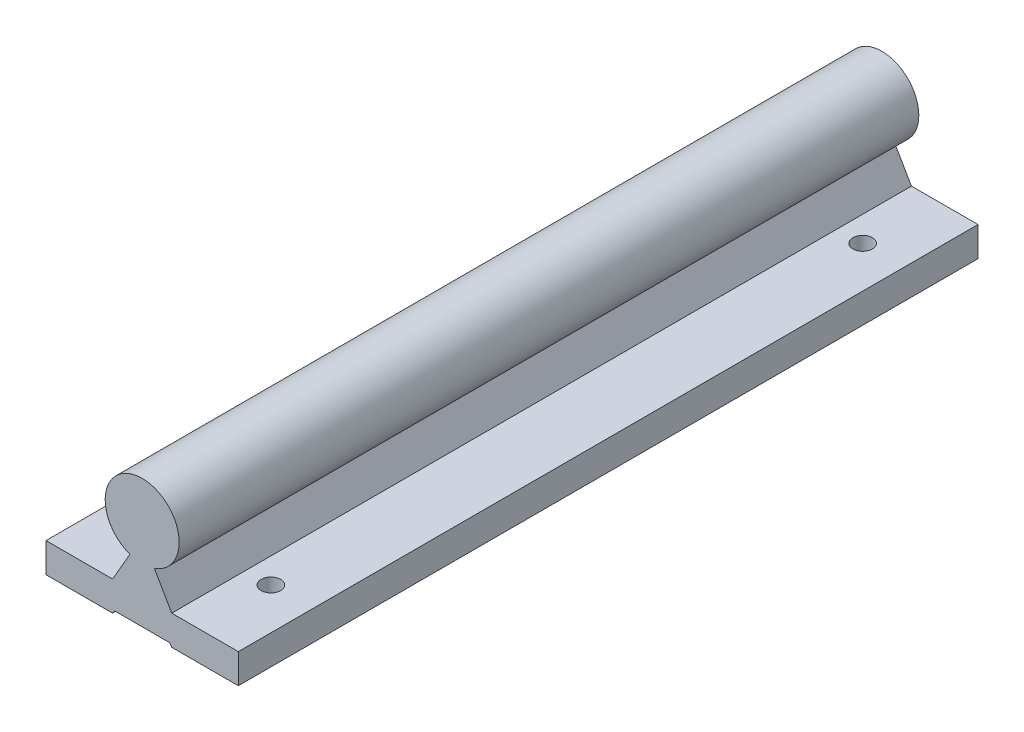
ISO-10303-21;
HEADER;
FILE_DESCRIPTION(('STEP AP214'),'2;1');
FILE_NAME('part.step','',(''),(''),'','','');
FILE_SCHEMA(('AUTOMOTIVE_DESIGN { 1 0 10303 214 1 1 1 1 }'));
ENDSEC;
DATA;
#1=APPLICATION_CONTEXT('core data for automotive mechanical design processes');
#2=APPLICATION_PROTOCOL_DEFINITION('international standard','automotive_design',2000,#1);
#3=PRODUCT_CONTEXT('',#1,'mechanical');
#4=PRODUCT('Part','Part','',(#3));
#5=PRODUCT_RELATED_PRODUCT_CATEGORY('part','',(#4));
#6=PRODUCT_DEFINITION_FORMATION('','',#4);
#7=PRODUCT_DEFINITION_CONTEXT('part definition',#1,'design');
#8=PRODUCT_DEFINITION('design','',#6,#7);
#9=PRODUCT_DEFINITION_SHAPE('','',#8);
#10=(LENGTH_UNIT() NAMED_UNIT(*) SI_UNIT(.MILLI.,.METRE.));
#11=(NAMED_UNIT(*) PLANE_ANGLE_UNIT() SI_UNIT($,.RADIAN.));
#12=(NAMED_UNIT(*) SI_UNIT($,.STERADIAN.) SOLID_ANGLE_UNIT());
#13=UNCERTAINTY_MEASURE_WITH_UNIT(LENGTH_MEASURE(1.E-05),#10,'distance_accuracy_value','');
#14=(GEOMETRIC_REPRESENTATION_CONTEXT(3) GLOBAL_UNCERTAINTY_ASSIGNED_CONTEXT((#13)) GLOBAL_UNIT_ASSIGNED_CONTEXT((#10,
#11,#12)) REPRESENTATION_CONTEXT('',''));
#15=CARTESIAN_POINT('',(0.,0.,0.));
#16=DIRECTION('',(0.,0.,1.));
#17=DIRECTION('',(1.,0.,0.));
#18=AXIS2_PLACEMENT_3D('',#15,#16,#17);
#19=CARTESIAN_POINT('',(0.,-31.97,250.));
#20=DIRECTION('',(0.,-1.,0.));
#21=DIRECTION('',(0.,0.,-1.));
#22=AXIS2_PLACEMENT_3D('',#19,#20,#21);
#23=PLANE('',#22);
#24=CARTESIAN_POINT('',(18.5,-31.97,225.));
#25=DIRECTION('',(0.,-1.,0.));
#26=DIRECTION('',(1.,0.,0.));
#27=AXIS2_PLACEMENT_3D('',#24,#25,#26);
#28=CIRCLE('',#27,3.3);
#29=CARTESIAN_POINT('',(21.8,-31.97,225.));
#30=VERTEX_POINT('',#29);
#31=EDGE_CURVE('E177',#30,#30,#28,.T.);
#32=ORIENTED_EDGE('',*,*,#31,.F.);
#33=EDGE_LOOP('',(#32));
#34=FACE_BOUND('',#33,.T.);
#35=DIRECTION('',(-1.,0.,0.));
#36=VECTOR('',#35,1.);
#37=CARTESIAN_POINT('',(0.,-31.97,0.));
#38=LINE('',#37,#36);
#39=CARTESIAN_POINT('',(32.5,-31.97,0.));
#40=VERTEX_POINT('',#39);
#41=CARTESIAN_POINT('',(10.,-31.97,0.));
#42=VERTEX_POINT('',#41);
#43=EDGE_CURVE('E229',#40,#42,#38,.T.);
#44=ORIENTED_EDGE('',*,*,#43,.F.);
#45=DIRECTION('',(0.,0.,-1.));
#46=VECTOR('',#45,1.);
#47=CARTESIAN_POINT('',(32.5,-31.97,250.));
#48=LINE('',#47,#46);
#49=CARTESIAN_POINT('',(32.5,-31.97,250.));
#50=VERTEX_POINT('',#49);
#51=EDGE_CURVE('E245',#50,#40,#48,.T.);
#52=ORIENTED_EDGE('',*,*,#51,.F.);
#53=DIRECTION('',(-1.,0.,0.));
#54=VECTOR('',#53,1.);
#55=CARTESIAN_POINT('',(0.,-31.97,250.));
#56=LINE('',#55,#54);
#57=CARTESIAN_POINT('',(10.,-31.97,250.));
#58=VERTEX_POINT('',#57);
#59=EDGE_CURVE('E200',#50,#58,#56,.T.);
#60=ORIENTED_EDGE('',*,*,#59,.T.);
#61=DIRECTION('',(0.,0.,-1.));
#62=VECTOR('',#61,1.);
#63=CARTESIAN_POINT('',(10.,-31.97,250.));
#64=LINE('',#63,#62);
#65=EDGE_CURVE('E247',#58,#42,#64,.T.);
#66=ORIENTED_EDGE('',*,*,#65,.T.);
#67=EDGE_LOOP('',(#44,#52,#60,#66));
#68=FACE_BOUND('',#67,.T.);
#69=CARTESIAN_POINT('',(18.5,-31.97,25.));
#70=DIRECTION('',(0.,-1.,0.));
#71=DIRECTION('',(1.,0.,0.));
#72=AXIS2_PLACEMENT_3D('',#69,#70,#71);
#73=CIRCLE('',#72,3.3);
#74=CARTESIAN_POINT('',(21.8,-31.97,25.));
#75=VERTEX_POINT('',#74);
#76=EDGE_CURVE('E158',#75,#75,#73,.T.);
#77=ORIENTED_EDGE('',*,*,#76,.F.);
#78=EDGE_LOOP('',(#77));
#79=FACE_BOUND('',#78,.T.);
#80=ADVANCED_FACE('F39',(#34,#68,#79),#23,.T.);
#81=CARTESIAN_POINT('',(0.,-21.97,250.));
#82=DIRECTION('',(0.,1.,0.));
#83=DIRECTION('',(0.,0.,1.));
#84=AXIS2_PLACEMENT_3D('',#81,#82,#83);
#85=PLANE('',#84);
#86=CARTESIAN_POINT('',(18.5,-21.97,225.));
#87=DIRECTION('',(0.,-1.,0.));
#88=DIRECTION('',(1.,0.,0.));
#89=AXIS2_PLACEMENT_3D('',#86,#87,#88);
#90=CIRCLE('',#89,3.3);
#91=CARTESIAN_POINT('',(21.8,-21.97,225.));
#92=VERTEX_POINT('',#91);
#93=EDGE_CURVE('E174',#92,#92,#90,.T.);
#94=ORIENTED_EDGE('',*,*,#93,.T.);
#95=EDGE_LOOP('',(#94));
#96=FACE_BOUND('',#95,.T.);
#97=DIRECTION('',(1.,0.,0.));
#98=VECTOR('',#97,1.);
#99=CARTESIAN_POINT('',(0.,-21.97,0.));
#100=LINE('',#99,#98);
#101=CARTESIAN_POINT('',(10.,-21.97,0.));
#102=VERTEX_POINT('',#101);
#103=CARTESIAN_POINT('',(32.5,-21.97,0.));
#104=VERTEX_POINT('',#103);
#105=EDGE_CURVE('E235',#102,#104,#100,.T.);
#106=ORIENTED_EDGE('',*,*,#105,.F.);
#107=DIRECTION('',(0.,0.,-1.));
#108=VECTOR('',#107,1.);
#109=CARTESIAN_POINT('',(10.,-21.97,250.));
#110=LINE('',#109,#108);
#111=CARTESIAN_POINT('',(10.,-21.97,250.));
#112=VERTEX_POINT('',#111);
#113=EDGE_CURVE('E241',#112,#102,#110,.T.);
#114=ORIENTED_EDGE('',*,*,#113,.F.);
#115=DIRECTION('',(1.,0.,0.));
#116=VECTOR('',#115,1.);
#117=CARTESIAN_POINT('',(0.,-21.97,250.));
#118=LINE('',#117,#116);
#119=CARTESIAN_POINT('',(32.5,-21.97,250.));
#120=VERTEX_POINT('',#119);
#121=EDGE_CURVE('E206',#112,#120,#118,.T.);
#122=ORIENTED_EDGE('',*,*,#121,.T.);
#123=DIRECTION('',(0.,0.,-1.));
#124=VECTOR('',#123,1.);
#125=CARTESIAN_POINT('',(32.5,-21.97,250.));
#126=LINE('',#125,#124);
#127=EDGE_CURVE('E243',#120,#104,#126,.T.);
#128=ORIENTED_EDGE('',*,*,#127,.T.);
#129=EDGE_LOOP('',(#106,#114,#122,#128));
#130=FACE_BOUND('',#129,.T.);
#131=CARTESIAN_POINT('',(18.5,-21.97,25.));
#132=DIRECTION('',(0.,-1.,0.));
#133=DIRECTION('',(1.,0.,0.));
#134=AXIS2_PLACEMENT_3D('',#131,#132,#133);
#135=CIRCLE('',#134,3.3);
#136=CARTESIAN_POINT('',(21.8,-21.97,25.));
#137=VERTEX_POINT('',#136);
#138=EDGE_CURVE('E159',#137,#137,#135,.T.);
#139=ORIENTED_EDGE('',*,*,#138,.T.);
#140=EDGE_LOOP('',(#139));
#141=FACE_BOUND('',#140,.T.);
#142=ADVANCED_FACE('F291',(#96,#130,#141),#85,.T.);
#143=CARTESIAN_POINT('',(0.,-21.97,250.));
#144=DIRECTION('',(0.,-1.,0.));
#145=DIRECTION('',(1.,0.,0.));
#146=AXIS2_PLACEMENT_3D('',#143,#144,#145);
#147=PLANE('',#146);
#148=DIRECTION('',(-1.,0.,0.));
#149=VECTOR('',#148,1.);
#150=CARTESIAN_POINT('',(0.,-21.97,0.));
#151=LINE('',#150,#149);
#152=CARTESIAN_POINT('',(-10.,-21.97,0.));
#153=VERTEX_POINT('',#152);
#154=CARTESIAN_POINT('',(-32.5,-21.97,0.));
#155=VERTEX_POINT('',#154);
#156=EDGE_CURVE('E214',#153,#155,#151,.T.);
#157=ORIENTED_EDGE('',*,*,#156,.T.);
#158=DIRECTION('',(0.,0.,-1.));
#159=VECTOR('',#158,1.);
#160=CARTESIAN_POINT('',(-32.5,-21.97,250.));
#161=LINE('',#160,#159);
#162=CARTESIAN_POINT('',(-32.5,-21.97,250.));
#163=VERTEX_POINT('',#162);
#164=EDGE_CURVE('E259',#163,#155,#161,.T.);
#165=ORIENTED_EDGE('',*,*,#164,.F.);
#166=DIRECTION('',(-1.,0.,0.));
#167=VECTOR('',#166,1.);
#168=CARTESIAN_POINT('',(0.,-21.97,250.));
#169=LINE('',#168,#167);
#170=CARTESIAN_POINT('',(-10.,-21.97,250.));
#171=VERTEX_POINT('',#170);
#172=EDGE_CURVE('E185',#171,#163,#169,.T.);
#173=ORIENTED_EDGE('',*,*,#172,.F.);
#174=DIRECTION('',(0.,0.,-1.));
#175=VECTOR('',#174,1.);
#176=CARTESIAN_POINT('',(-10.,-21.97,250.));
#177=LINE('',#176,#175);
#178=EDGE_CURVE('E262',#171,#153,#177,.T.);
#179=ORIENTED_EDGE('',*,*,#178,.T.);
#180=EDGE_LOOP('',(#157,#165,#173,#179));
#181=FACE_BOUND('',#180,.T.);
#182=CARTESIAN_POINT('',(-18.5,-21.97,225.));
#183=DIRECTION('',(0.,1.,0.));
#184=DIRECTION('',(-1.,0.,0.));
#185=AXIS2_PLACEMENT_3D('',#182,#183,#184);
#186=CIRCLE('',#185,3.3);
#187=CARTESIAN_POINT('',(-21.8,-21.97,225.));
#188=VERTEX_POINT('',#187);
#189=EDGE_CURVE('E171',#188,#188,#186,.T.);
#190=ORIENTED_EDGE('',*,*,#189,.F.);
#191=EDGE_LOOP('',(#190));
#192=FACE_BOUND('',#191,.T.);
#193=CARTESIAN_POINT('',(-18.5,-21.97,25.));
#194=DIRECTION('',(0.,-1.,0.));
#195=DIRECTION('',(1.,0.,0.));
#196=AXIS2_PLACEMENT_3D('',#193,#194,#195);
#197=CIRCLE('',#196,3.3);
#198=CARTESIAN_POINT('',(-15.2,-21.97,25.));
#199=VERTEX_POINT('',#198);
#200=EDGE_CURVE('E165',#199,#199,#197,.T.);
#201=ORIENTED_EDGE('',*,*,#200,.T.);
#202=EDGE_LOOP('',(#201));
#203=FACE_BOUND('',#202,.T.);
#204=ADVANCED_FACE('F277',(#181,#192,#203),#147,.F.);
#205=CARTESIAN_POINT('',(0.,-31.97,250.));
#206=DIRECTION('',(0.,1.,0.));
#207=DIRECTION('',(-1.,0.,0.));
#208=AXIS2_PLACEMENT_3D('',#205,#206,#207);
#209=PLANE('',#208);
#210=DIRECTION('',(1.,0.,0.));
#211=VECTOR('',#210,1.);
#212=CARTESIAN_POINT('',(0.,-31.97,0.));
#213=LINE('',#212,#211);
#214=CARTESIAN_POINT('',(-32.5,-31.97,0.));
#215=VERTEX_POINT('',#214);
#216=CARTESIAN_POINT('',(-10.,-31.97,0.));
#217=VERTEX_POINT('',#216);
#218=EDGE_CURVE('E218',#215,#217,#213,.T.);
#219=ORIENTED_EDGE('',*,*,#218,.T.);
#220=DIRECTION('',(0.,0.,-1.));
#221=VECTOR('',#220,1.);
#222=CARTESIAN_POINT('',(-10.,-31.97,250.));
#223=LINE('',#222,#221);
#224=CARTESIAN_POINT('',(-10.,-31.97,250.));
#225=VERTEX_POINT('',#224);
#226=EDGE_CURVE('E253',#225,#217,#223,.T.);
#227=ORIENTED_EDGE('',*,*,#226,.F.);
#228=DIRECTION('',(1.,0.,0.));
#229=VECTOR('',#228,1.);
#230=CARTESIAN_POINT('',(0.,-31.97,250.));
#231=LINE('',#230,#229);
#232=CARTESIAN_POINT('',(-32.5,-31.97,250.));
#233=VERTEX_POINT('',#232);
#234=EDGE_CURVE('E190',#233,#225,#231,.T.);
#235=ORIENTED_EDGE('',*,*,#234,.F.);
#236=DIRECTION('',(0.,0.,-1.));
#237=VECTOR('',#236,1.);
#238=CARTESIAN_POINT('',(-32.5,-31.97,250.));
#239=LINE('',#238,#237);
#240=EDGE_CURVE('E256',#233,#215,#239,.T.);
#241=ORIENTED_EDGE('',*,*,#240,.T.);
#242=EDGE_LOOP('',(#219,#227,#235,#241));
#243=FACE_BOUND('',#242,.T.);
#244=CARTESIAN_POINT('',(-18.5,-31.97,225.));
#245=DIRECTION('',(0.,1.,0.));
#246=DIRECTION('',(-1.,0.,0.));
#247=AXIS2_PLACEMENT_3D('',#244,#245,#246);
#248=CIRCLE('',#247,3.3);
#249=CARTESIAN_POINT('',(-21.8,-31.97,225.));
#250=VERTEX_POINT('',#249);
#251=EDGE_CURVE('E168',#250,#250,#248,.T.);
#252=ORIENTED_EDGE('',*,*,#251,.T.);
#253=EDGE_LOOP('',(#252));
#254=FACE_BOUND('',#253,.T.);
#255=CARTESIAN_POINT('',(-18.5,-31.97,25.));
#256=DIRECTION('',(0.,-1.,0.));
#257=DIRECTION('',(1.,0.,0.));
#258=AXIS2_PLACEMENT_3D('',#255,#256,#257);
#259=CIRCLE('',#258,3.3);
#260=CARTESIAN_POINT('',(-15.2,-31.97,25.));
#261=VERTEX_POINT('',#260);
#262=EDGE_CURVE('E162',#261,#261,#259,.T.);
#263=ORIENTED_EDGE('',*,*,#262,.F.);
#264=EDGE_LOOP('',(#263));
#265=FACE_BOUND('',#264,.T.);
#266=ADVANCED_FACE('F317',(#243,#254,#265),#209,.F.);
#267=CARTESIAN_POINT('',(0.,0.,250.));
#268=DIRECTION('',(0.,0.,-1.));
#269=DIRECTION('',(-1.,0.,0.));
#270=AXIS2_PLACEMENT_3D('',#267,#268,#269);
#271=CYLINDRICAL_SURFACE('',#270,12.5);
#272=DIRECTION('',(0.,0.,-1.));
#273=VECTOR('',#272,1.);
#274=CARTESIAN_POINT('',(-4.12767088497881,-11.7988276140173,250.));
#275=LINE('',#274,#273);
#276=CARTESIAN_POINT('',(-4.12767088497881,-11.7988276140173,250.));
#277=VERTEX_POINT('',#276);
#278=CARTESIAN_POINT('',(-4.12767088497881,-11.7988276140173,0.));
#279=VERTEX_POINT('',#278);
#280=EDGE_CURVE('E57',#277,#279,#275,.T.);
#281=ORIENTED_EDGE('',*,*,#280,.F.);
#282=CARTESIAN_POINT('',(0.,0.,250.));
#283=DIRECTION('',(0.,0.,1.));
#284=DIRECTION('',(1.,0.,0.));
#285=AXIS2_PLACEMENT_3D('',#282,#283,#284);
#286=CIRCLE('',#285,12.5);
#287=CARTESIAN_POINT('',(4.12767088497882,-11.7988276140173,250.));
#288=VERTEX_POINT('',#287);
#289=EDGE_CURVE('E11',#288,#277,#286,.T.);
#290=ORIENTED_EDGE('',*,*,#289,.F.);
#291=DIRECTION('',(0.,0.,-1.));
#292=VECTOR('',#291,1.);
#293=CARTESIAN_POINT('',(4.12767088497882,-11.7988276140173,250.));
#294=LINE('',#293,#292);
#295=CARTESIAN_POINT('',(4.12767088497882,-11.7988276140173,0.));
#296=VERTEX_POINT('',#295);
#297=EDGE_CURVE('E212',#288,#296,#294,.T.);
#298=ORIENTED_EDGE('',*,*,#297,.T.);
#299=CARTESIAN_POINT('',(0.,0.,0.));
#300=DIRECTION('',(0.,0.,1.));
#301=DIRECTION('',(1.,0.,0.));
#302=AXIS2_PLACEMENT_3D('',#299,#300,#301);
#303=CIRCLE('',#302,12.5);
#304=EDGE_CURVE('E43',#296,#279,#303,.T.);
#305=ORIENTED_EDGE('',*,*,#304,.T.);
#306=EDGE_LOOP('',(#281,#290,#298,#305));
#307=FACE_BOUND('',#306,.T.);
#308=ADVANCED_FACE('F41',(#307),#271,.T.);
#309=CARTESIAN_POINT('',(0.,0.,250.));
#310=DIRECTION('',(0.,0.,1.));
#311=DIRECTION('',(1.,0.,0.));
#312=AXIS2_PLACEMENT_3D('',#309,#310,#311);
#313=PLANE('',#312);
#314=ORIENTED_EDGE('',*,*,#289,.T.);
#315=DIRECTION('',(-0.500000000000001,-0.866025403784438,0.));
#316=VECTOR('',#315,1.);
#317=CARTESIAN_POINT('',(2.01328906057208,-1.16237298107782,250.));
#318=LINE('',#317,#316);
#319=EDGE_CURVE('E183',#277,#171,#318,.T.);
#320=ORIENTED_EDGE('',*,*,#319,.T.);
#321=ORIENTED_EDGE('',*,*,#172,.T.);
#322=DIRECTION('',(0.,-1.,0.));
#323=VECTOR('',#322,1.);
#324=CARTESIAN_POINT('',(-32.5,0.,250.));
#325=LINE('',#324,#323);
#326=EDGE_CURVE('E188',#163,#233,#325,.T.);
#327=ORIENTED_EDGE('',*,*,#326,.T.);
#328=ORIENTED_EDGE('',*,*,#234,.T.);
#329=DIRECTION('',(0.573576436351048,0.81915204428899,0.));
#330=VECTOR('',#329,1.);
#331=CARTESIAN_POINT('',(8.31088582663444,-5.8193449050097,250.));
#332=LINE('',#331,#330);
#333=CARTESIAN_POINT('',(-9.29979246179029,-30.97,250.));
#334=VERTEX_POINT('',#333);
#335=EDGE_CURVE('E192',#225,#334,#332,.T.);
#336=ORIENTED_EDGE('',*,*,#335,.T.);
#337=DIRECTION('',(-1.,0.,0.));
#338=VECTOR('',#337,1.);
#339=CARTESIAN_POINT('',(0.,-30.97,250.));
#340=LINE('',#339,#338);
#341=CARTESIAN_POINT('',(9.2997924617903,-30.97,250.));
#342=VERTEX_POINT('',#341);
#343=EDGE_CURVE('E194',#342,#334,#340,.T.);
#344=ORIENTED_EDGE('',*,*,#343,.F.);
#345=DIRECTION('',(-0.573576436351049,0.81915204428899,0.));
#346=VECTOR('',#345,1.);
#347=CARTESIAN_POINT('',(-8.31088582663445,-5.81934490500972,250.));
#348=LINE('',#347,#346);
#349=EDGE_CURVE('E197',#58,#342,#348,.T.);
#350=ORIENTED_EDGE('',*,*,#349,.F.);
#351=ORIENTED_EDGE('',*,*,#59,.F.);
#352=DIRECTION('',(0.,-1.,0.));
#353=VECTOR('',#352,1.);
#354=CARTESIAN_POINT('',(32.5,0.,250.));
#355=LINE('',#354,#353);
#356=EDGE_CURVE('E203',#120,#50,#355,.T.);
#357=ORIENTED_EDGE('',*,*,#356,.F.);
#358=ORIENTED_EDGE('',*,*,#121,.F.);
#359=DIRECTION('',(0.500000000000001,-0.866025403784438,0.));
#360=VECTOR('',#359,1.);
#361=CARTESIAN_POINT('',(-2.01328906057208,-1.16237298107782,250.));
#362=LINE('',#361,#360);
#363=EDGE_CURVE('E209',#288,#112,#362,.T.);
#364=ORIENTED_EDGE('',*,*,#363,.F.);
#365=EDGE_LOOP('',(#314,#320,#321,#327,#328,#336,#344,#350,#351,#357,#358,#364));
#366=FACE_BOUND('',#365,.T.);
#367=ADVANCED_FACE('F282',(#366),#313,.T.);
#368=CARTESIAN_POINT('',(0.,0.,0.));
#369=DIRECTION('',(0.,0.,1.));
#370=DIRECTION('',(1.,0.,0.));
#371=AXIS2_PLACEMENT_3D('',#368,#369,#370);
#372=PLANE('',#371);
#373=ORIENTED_EDGE('',*,*,#304,.F.);
#374=DIRECTION('',(0.500000000000001,-0.866025403784438,0.));
#375=VECTOR('',#374,1.);
#376=CARTESIAN_POINT('',(-2.01328906057208,-1.16237298107782,0.));
#377=LINE('',#376,#375);
#378=EDGE_CURVE('E186',#296,#102,#377,.T.);
#379=ORIENTED_EDGE('',*,*,#378,.T.);
#380=ORIENTED_EDGE('',*,*,#105,.T.);
#381=DIRECTION('',(0.,-1.,0.));
#382=VECTOR('',#381,1.);
#383=CARTESIAN_POINT('',(32.5,0.,0.));
#384=LINE('',#383,#382);
#385=EDGE_CURVE('E232',#104,#40,#384,.T.);
#386=ORIENTED_EDGE('',*,*,#385,.T.);
#387=ORIENTED_EDGE('',*,*,#43,.T.);
#388=DIRECTION('',(-0.573576436351049,0.81915204428899,0.));
#389=VECTOR('',#388,1.);
#390=CARTESIAN_POINT('',(-8.31088582663445,-5.81934490500972,0.));
#391=LINE('',#390,#389);
#392=CARTESIAN_POINT('',(9.2997924617903,-30.97,0.));
#393=VERTEX_POINT('',#392);
#394=EDGE_CURVE('E226',#42,#393,#391,.T.);
#395=ORIENTED_EDGE('',*,*,#394,.T.);
#396=DIRECTION('',(-1.,0.,0.));
#397=VECTOR('',#396,1.);
#398=CARTESIAN_POINT('',(0.,-30.97,0.));
#399=LINE('',#398,#397);
#400=CARTESIAN_POINT('',(-9.29979246179029,-30.97,0.));
#401=VERTEX_POINT('',#400);
#402=EDGE_CURVE('E223',#393,#401,#399,.T.);
#403=ORIENTED_EDGE('',*,*,#402,.T.);
#404=DIRECTION('',(0.573576436351048,0.81915204428899,0.));
#405=VECTOR('',#404,1.);
#406=CARTESIAN_POINT('',(8.31088582663444,-5.8193449050097,0.));
#407=LINE('',#406,#405);
#408=EDGE_CURVE('E220',#217,#401,#407,.T.);
#409=ORIENTED_EDGE('',*,*,#408,.F.);
#410=ORIENTED_EDGE('',*,*,#218,.F.);
#411=DIRECTION('',(0.,-1.,0.));
#412=VECTOR('',#411,1.);
#413=CARTESIAN_POINT('',(-32.5,0.,0.));
#414=LINE('',#413,#412);
#415=EDGE_CURVE('E216',#155,#215,#414,.T.);
#416=ORIENTED_EDGE('',*,*,#415,.F.);
#417=ORIENTED_EDGE('',*,*,#156,.F.);
#418=DIRECTION('',(-0.500000000000001,-0.866025403784438,0.));
#419=VECTOR('',#418,1.);
#420=CARTESIAN_POINT('',(2.01328906057208,-1.16237298107782,0.));
#421=LINE('',#420,#419);
#422=EDGE_CURVE('E180',#279,#153,#421,.T.);
#423=ORIENTED_EDGE('',*,*,#422,.F.);
#424=EDGE_LOOP('',(#373,#379,#380,#386,#387,#395,#403,#409,#410,#416,#417,#423));
#425=FACE_BOUND('',#424,.T.);
#426=ADVANCED_FACE('F270',(#425),#372,.F.);
#427=CARTESIAN_POINT('',(2.01328906057208,-1.16237298107782,250.));
#428=DIRECTION('',(0.866025403784438,-0.500000000000001,0.));
#429=DIRECTION('',(0.500000000000001,0.866025403784438,0.));
#430=AXIS2_PLACEMENT_3D('',#427,#428,#429);
#431=PLANE('',#430);
#432=ORIENTED_EDGE('',*,*,#422,.T.);
#433=ORIENTED_EDGE('',*,*,#178,.F.);
#434=ORIENTED_EDGE('',*,*,#319,.F.);
#435=ORIENTED_EDGE('',*,*,#280,.T.);
#436=EDGE_LOOP('',(#432,#433,#434,#435));
#437=FACE_BOUND('',#436,.T.);
#438=ADVANCED_FACE('F274',(#437),#431,.F.);
#439=CARTESIAN_POINT('',(-32.5,0.,250.));
#440=DIRECTION('',(1.,0.,0.));
#441=DIRECTION('',(0.,1.,0.));
#442=AXIS2_PLACEMENT_3D('',#439,#440,#441);
#443=PLANE('',#442);
#444=ORIENTED_EDGE('',*,*,#415,.T.);
#445=ORIENTED_EDGE('',*,*,#240,.F.);
#446=ORIENTED_EDGE('',*,*,#326,.F.);
#447=ORIENTED_EDGE('',*,*,#164,.T.);
#448=EDGE_LOOP('',(#444,#445,#446,#447));
#449=FACE_BOUND('',#448,.T.);
#450=ADVANCED_FACE('F320',(#449),#443,.F.);
#451=CARTESIAN_POINT('',(8.31088582663444,-5.8193449050097,250.));
#452=DIRECTION('',(-0.81915204428899,0.573576436351048,0.));
#453=DIRECTION('',(-0.573576436351048,-0.81915204428899,0.));
#454=AXIS2_PLACEMENT_3D('',#451,#452,#453);
#455=PLANE('',#454);
#456=ORIENTED_EDGE('',*,*,#408,.T.);
#457=DIRECTION('',(0.,0.,-1.));
#458=VECTOR('',#457,1.);
#459=CARTESIAN_POINT('',(-9.29979246179029,-30.97,250.));
#460=LINE('',#459,#458);
#461=EDGE_CURVE('E251',#334,#401,#460,.T.);
#462=ORIENTED_EDGE('',*,*,#461,.F.);
#463=ORIENTED_EDGE('',*,*,#335,.F.);
#464=ORIENTED_EDGE('',*,*,#226,.T.);
#465=EDGE_LOOP('',(#456,#462,#463,#464));
#466=FACE_BOUND('',#465,.T.);
#467=ADVANCED_FACE('F313',(#466),#455,.F.);
#468=CARTESIAN_POINT('',(0.,-30.97,250.));
#469=DIRECTION('',(0.,-1.,0.));
#470=DIRECTION('',(1.,0.,0.));
#471=AXIS2_PLACEMENT_3D('',#468,#469,#470);
#472=PLANE('',#471);
#473=CARTESIAN_POINT('',(0.,-30.97,25.));
#474=DIRECTION('',(0.,-1.,0.));
#475=DIRECTION('',(0.,0.,-1.));
#476=AXIS2_PLACEMENT_3D('',#473,#474,#475);
#477=CIRCLE('',#476,5.);
#478=CARTESIAN_POINT('',(0.,-30.97,20.));
#479=VERTEX_POINT('',#478);
#480=EDGE_CURVE('E541',#479,#479,#477,.T.);
#481=ORIENTED_EDGE('',*,*,#480,.F.);
#482=EDGE_LOOP('',(#481));
#483=FACE_BOUND('',#482,.T.);
#484=CARTESIAN_POINT('',(0.,-30.97,225.));
#485=DIRECTION('',(0.,-1.,0.));
#486=DIRECTION('',(0.,0.,-1.));
#487=AXIS2_PLACEMENT_3D('',#484,#485,#486);
#488=CIRCLE('',#487,5.);
#489=CARTESIAN_POINT('',(0.,-30.97,220.));
#490=VERTEX_POINT('',#489);
#491=EDGE_CURVE('E139',#490,#490,#488,.T.);
#492=ORIENTED_EDGE('',*,*,#491,.F.);
#493=EDGE_LOOP('',(#492));
#494=FACE_BOUND('',#493,.T.);
#495=ORIENTED_EDGE('',*,*,#402,.F.);
#496=DIRECTION('',(0.,0.,-1.));
#497=VECTOR('',#496,1.);
#498=CARTESIAN_POINT('',(9.2997924617903,-30.97,250.));
#499=LINE('',#498,#497);
#500=EDGE_CURVE('E249',#342,#393,#499,.T.);
#501=ORIENTED_EDGE('',*,*,#500,.F.);
#502=ORIENTED_EDGE('',*,*,#343,.T.);
#503=ORIENTED_EDGE('',*,*,#461,.T.);
#504=EDGE_LOOP('',(#495,#501,#502,#503));
#505=FACE_BOUND('',#504,.T.);
#506=ADVANCED_FACE('F308',(#483,#494,#505),#472,.T.);
#507=CARTESIAN_POINT('',(-8.31088582663445,-5.81934490500972,250.));
#508=DIRECTION('',(-0.81915204428899,-0.573576436351049,0.));
#509=DIRECTION('',(0.573576436351049,-0.81915204428899,0.));
#510=AXIS2_PLACEMENT_3D('',#507,#508,#509);
#511=PLANE('',#510);
#512=ORIENTED_EDGE('',*,*,#394,.F.);
#513=ORIENTED_EDGE('',*,*,#65,.F.);
#514=ORIENTED_EDGE('',*,*,#349,.T.);
#515=ORIENTED_EDGE('',*,*,#500,.T.);
#516=EDGE_LOOP('',(#512,#513,#514,#515));
#517=FACE_BOUND('',#516,.T.);
#518=ADVANCED_FACE('F303',(#517),#511,.T.);
#519=CARTESIAN_POINT('',(32.5,0.,250.));
#520=DIRECTION('',(1.,0.,0.));
#521=DIRECTION('',(0.,0.,-1.));
#522=AXIS2_PLACEMENT_3D('',#519,#520,#521);
#523=PLANE('',#522);
#524=ORIENTED_EDGE('',*,*,#385,.F.);
#525=ORIENTED_EDGE('',*,*,#127,.F.);
#526=ORIENTED_EDGE('',*,*,#356,.T.);
#527=ORIENTED_EDGE('',*,*,#51,.T.);
#528=EDGE_LOOP('',(#524,#525,#526,#527));
#529=FACE_BOUND('',#528,.T.);
#530=ADVANCED_FACE('F296',(#529),#523,.T.);
#531=CARTESIAN_POINT('',(-2.01328906057208,-1.16237298107782,250.));
#532=DIRECTION('',(0.866025403784438,0.500000000000001,0.));
#533=DIRECTION('',(-0.500000000000001,0.866025403784438,0.));
#534=AXIS2_PLACEMENT_3D('',#531,#532,#533);
#535=PLANE('',#534);
#536=ORIENTED_EDGE('',*,*,#378,.F.);
#537=ORIENTED_EDGE('',*,*,#297,.F.);
#538=ORIENTED_EDGE('',*,*,#363,.T.);
#539=ORIENTED_EDGE('',*,*,#113,.T.);
#540=EDGE_LOOP('',(#536,#537,#538,#539));
#541=FACE_BOUND('',#540,.T.);
#542=ADVANCED_FACE('F288',(#541),#535,.T.);
#543=CARTESIAN_POINT('',(18.5,-31.97,225.));
#544=DIRECTION('',(0.,1.,0.));
#545=DIRECTION('',(-1.,0.,0.));
#546=AXIS2_PLACEMENT_3D('',#543,#544,#545);
#547=CYLINDRICAL_SURFACE('',#546,3.3);
#548=ORIENTED_EDGE('',*,*,#31,.T.);
#549=EDGE_LOOP('',(#548));
#550=FACE_BOUND('',#549,.T.);
#551=ORIENTED_EDGE('',*,*,#93,.F.);
#552=EDGE_LOOP('',(#551));
#553=FACE_BOUND('',#552,.T.);
#554=ADVANCED_FACE('F396',(#550,#553),#547,.F.);
#555=CARTESIAN_POINT('',(-18.5,-31.97,225.));
#556=DIRECTION('',(0.,1.,0.));
#557=DIRECTION('',(-1.,0.,0.));
#558=AXIS2_PLACEMENT_3D('',#555,#556,#557);
#559=CYLINDRICAL_SURFACE('',#558,3.3);
#560=ORIENTED_EDGE('',*,*,#251,.F.);
#561=EDGE_LOOP('',(#560));
#562=FACE_BOUND('',#561,.T.);
#563=ORIENTED_EDGE('',*,*,#189,.T.);
#564=EDGE_LOOP('',(#563));
#565=FACE_BOUND('',#564,.T.);
#566=ADVANCED_FACE('F424',(#562,#565),#559,.F.);
#567=CARTESIAN_POINT('',(-18.5,-31.97,25.));
#568=DIRECTION('',(0.,1.,0.));
#569=DIRECTION('',(-1.,0.,0.));
#570=AXIS2_PLACEMENT_3D('',#567,#568,#569);
#571=CYLINDRICAL_SURFACE('',#570,3.3);
#572=ORIENTED_EDGE('',*,*,#262,.T.);
#573=EDGE_LOOP('',(#572));
#574=FACE_BOUND('',#573,.T.);
#575=ORIENTED_EDGE('',*,*,#200,.F.);
#576=EDGE_LOOP('',(#575));
#577=FACE_BOUND('',#576,.T.);
#578=ADVANCED_FACE('F434',(#574,#577),#571,.F.);
#579=CARTESIAN_POINT('',(18.5,-31.97,25.));
#580=DIRECTION('',(0.,1.,0.));
#581=DIRECTION('',(-1.,0.,0.));
#582=AXIS2_PLACEMENT_3D('',#579,#580,#581);
#583=CYLINDRICAL_SURFACE('',#582,3.3);
#584=ORIENTED_EDGE('',*,*,#76,.T.);
#585=EDGE_LOOP('',(#584));
#586=FACE_BOUND('',#585,.T.);
#587=ORIENTED_EDGE('',*,*,#138,.F.);
#588=EDGE_LOOP('',(#587));
#589=FACE_BOUND('',#588,.T.);
#590=ADVANCED_FACE('F444',(#586,#589),#583,.F.);
#591=CARTESIAN_POINT('',(0.,-12.97,225.));
#592=DIRECTION('',(0.,-1.,0.));
#593=DIRECTION('',(0.,0.,-1.));
#594=AXIS2_PLACEMENT_3D('',#591,#592,#593);
#595=CONICAL_SURFACE('',#594,2.65,1.02974425867665);
#596=CARTESIAN_POINT('',(0.,-11.377719359577,225.));
#597=VERTEX_POINT('',#596);
#598=VERTEX_LOOP('',#597);
#599=FACE_BOUND('',#598,.T.);
#600=CARTESIAN_POINT('',(0.,-12.97,225.));
#601=DIRECTION('',(0.,-1.,0.));
#602=DIRECTION('',(0.,0.,-1.));
#603=AXIS2_PLACEMENT_3D('',#600,#601,#602);
#604=CIRCLE('',#603,2.65);
#605=CARTESIAN_POINT('',(0.,-12.97,222.35));
#606=VERTEX_POINT('',#605);
#607=EDGE_CURVE('E155',#606,#606,#604,.T.);
#608=ORIENTED_EDGE('',*,*,#607,.T.);
#609=EDGE_LOOP('',(#608));
#610=FACE_BOUND('',#609,.T.);
#611=ADVANCED_FACE('F454',(#599,#610),#595,.F.);
#612=CARTESIAN_POINT('',(0.,-30.97,225.));
#613=DIRECTION('',(0.,-1.,0.));
#614=DIRECTION('',(0.,0.,-1.));
#615=AXIS2_PLACEMENT_3D('',#612,#613,#614);
#616=CYLINDRICAL_SURFACE('',#615,2.65);
#617=ORIENTED_EDGE('',*,*,#607,.F.);
#618=EDGE_LOOP('',(#617));
#619=FACE_BOUND('',#618,.T.);
#620=CARTESIAN_POINT('',(0.,-25.97,225.));
#621=DIRECTION('',(0.,-1.,0.));
#622=DIRECTION('',(0.,0.,-1.));
#623=AXIS2_PLACEMENT_3D('',#620,#621,#622);
#624=CIRCLE('',#623,2.65);
#625=CARTESIAN_POINT('',(0.,-25.97,222.35));
#626=VERTEX_POINT('',#625);
#627=EDGE_CURVE('E152',#626,#626,#624,.T.);
#628=ORIENTED_EDGE('',*,*,#627,.T.);
#629=EDGE_LOOP('',(#628));
#630=FACE_BOUND('',#629,.T.);
#631=ADVANCED_FACE('F469',(#619,#630),#616,.F.);
#632=CARTESIAN_POINT('',(2.65,-25.97,225.));
#633=DIRECTION('',(0.,1.,0.));
#634=DIRECTION('',(0.,0.,1.));
#635=AXIS2_PLACEMENT_3D('',#632,#633,#634);
#636=PLANE('',#635);
#637=ORIENTED_EDGE('',*,*,#627,.F.);
#638=EDGE_LOOP('',(#637));
#639=FACE_BOUND('',#638,.T.);
#640=CARTESIAN_POINT('',(0.,-25.97,225.));
#641=DIRECTION('',(0.,-1.,0.));
#642=DIRECTION('',(0.,0.,-1.));
#643=AXIS2_PLACEMENT_3D('',#640,#641,#642);
#644=CIRCLE('',#643,5.);
#645=CARTESIAN_POINT('',(0.,-25.97,220.));
#646=VERTEX_POINT('',#645);
#647=EDGE_CURVE('E143',#646,#646,#644,.T.);
#648=ORIENTED_EDGE('',*,*,#647,.T.);
#649=EDGE_LOOP('',(#648));
#650=FACE_BOUND('',#649,.T.);
#651=ADVANCED_FACE('F479',(#639,#650),#636,.F.);
#652=CARTESIAN_POINT('',(0.,-30.97,225.));
#653=DIRECTION('',(0.,-1.,0.));
#654=DIRECTION('',(0.,0.,-1.));
#655=AXIS2_PLACEMENT_3D('',#652,#653,#654);
#656=CYLINDRICAL_SURFACE('',#655,5.);
#657=ORIENTED_EDGE('',*,*,#647,.F.);
#658=EDGE_LOOP('',(#657));
#659=FACE_BOUND('',#658,.T.);
#660=ORIENTED_EDGE('',*,*,#491,.T.);
#661=EDGE_LOOP('',(#660));
#662=FACE_BOUND('',#661,.T.);
#663=ADVANCED_FACE('F133',(#659,#662),#656,.F.);
#664=CARTESIAN_POINT('',(0.,-12.97,25.));
#665=DIRECTION('',(0.,-1.,0.));
#666=DIRECTION('',(0.,0.,-1.));
#667=AXIS2_PLACEMENT_3D('',#664,#665,#666);
#668=CONICAL_SURFACE('',#667,2.65,1.02974425867665);
#669=CARTESIAN_POINT('',(0.,-11.377719359577,25.));
#670=VERTEX_POINT('',#669);
#671=VERTEX_LOOP('',#670);
#672=FACE_BOUND('',#671,.T.);
#673=CARTESIAN_POINT('',(0.,-12.97,25.));
#674=DIRECTION('',(0.,-1.,0.));
#675=DIRECTION('',(0.,0.,-1.));
#676=AXIS2_PLACEMENT_3D('',#673,#674,#675);
#677=CIRCLE('',#676,2.65);
#678=CARTESIAN_POINT('',(0.,-12.97,22.35));
#679=VERTEX_POINT('',#678);
#680=EDGE_CURVE('E137',#679,#679,#677,.T.);
#681=ORIENTED_EDGE('',*,*,#680,.T.);
#682=EDGE_LOOP('',(#681));
#683=FACE_BOUND('',#682,.T.);
#684=ADVANCED_FACE('F129',(#672,#683),#668,.F.);
#685=CARTESIAN_POINT('',(0.,-30.97,25.));
#686=DIRECTION('',(0.,-1.,0.));
#687=DIRECTION('',(0.,0.,-1.));
#688=AXIS2_PLACEMENT_3D('',#685,#686,#687);
#689=CYLINDRICAL_SURFACE('',#688,2.65);
#690=ORIENTED_EDGE('',*,*,#680,.F.);
#691=EDGE_LOOP('',(#690));
#692=FACE_BOUND('',#691,.T.);
#693=CARTESIAN_POINT('',(0.,-25.97,25.));
#694=DIRECTION('',(0.,-1.,0.));
#695=DIRECTION('',(0.,0.,-1.));
#696=AXIS2_PLACEMENT_3D('',#693,#694,#695);
#697=CIRCLE('',#696,2.65);
#698=CARTESIAN_POINT('',(0.,-25.97,22.35));
#699=VERTEX_POINT('',#698);
#700=EDGE_CURVE('E140',#699,#699,#697,.T.);
#701=ORIENTED_EDGE('',*,*,#700,.T.);
#702=EDGE_LOOP('',(#701));
#703=FACE_BOUND('',#702,.T.);
#704=ADVANCED_FACE('F132',(#692,#703),#689,.F.);
#705=CARTESIAN_POINT('',(2.65,-25.97,25.));
#706=DIRECTION('',(0.,1.,0.));
#707=DIRECTION('',(0.,0.,1.));
#708=AXIS2_PLACEMENT_3D('',#705,#706,#707);
#709=PLANE('',#708);
#710=ORIENTED_EDGE('',*,*,#700,.F.);
#711=EDGE_LOOP('',(#710));
#712=FACE_BOUND('',#711,.T.);
#713=CARTESIAN_POINT('',(0.,-25.97,25.));
#714=DIRECTION('',(0.,-1.,0.));
#715=DIRECTION('',(0.,0.,-1.));
#716=AXIS2_PLACEMENT_3D('',#713,#714,#715);
#717=CIRCLE('',#716,5.);
#718=CARTESIAN_POINT('',(0.,-25.97,20.));
#719=VERTEX_POINT('',#718);
#720=EDGE_CURVE('E146',#719,#719,#717,.T.);
#721=ORIENTED_EDGE('',*,*,#720,.T.);
#722=EDGE_LOOP('',(#721));
#723=FACE_BOUND('',#722,.T.);
#724=ADVANCED_FACE('F513',(#712,#723),#709,.F.);
#725=CARTESIAN_POINT('',(0.,-30.97,25.));
#726=DIRECTION('',(0.,-1.,0.));
#727=DIRECTION('',(0.,0.,-1.));
#728=AXIS2_PLACEMENT_3D('',#725,#726,#727);
#729=CYLINDRICAL_SURFACE('',#728,5.);
#730=ORIENTED_EDGE('',*,*,#720,.F.);
#731=EDGE_LOOP('',(#730));
#732=FACE_BOUND('',#731,.T.);
#733=ORIENTED_EDGE('',*,*,#480,.T.);
#734=EDGE_LOOP('',(#733));
#735=FACE_BOUND('',#734,.T.);
#736=ADVANCED_FACE('F522',(#732,#735),#729,.F.);
#737=CLOSED_SHELL('',(#80,#142,#204,#266,#308,#367,#426,#438,#450,#467,#506,#518,#530,#542,#554,
#566,#578,#590,#611,#631,#651,#663,#684,#704,#724,#736));
#738=MANIFOLD_SOLID_BREP('B2',#737);
#739=ADVANCED_BREP_SHAPE_REPRESENTATION('',(#18,#738),#14);
#740=SHAPE_DEFINITION_REPRESENTATION(#9,#739);
ENDSEC;
END-ISO-10303-21;
